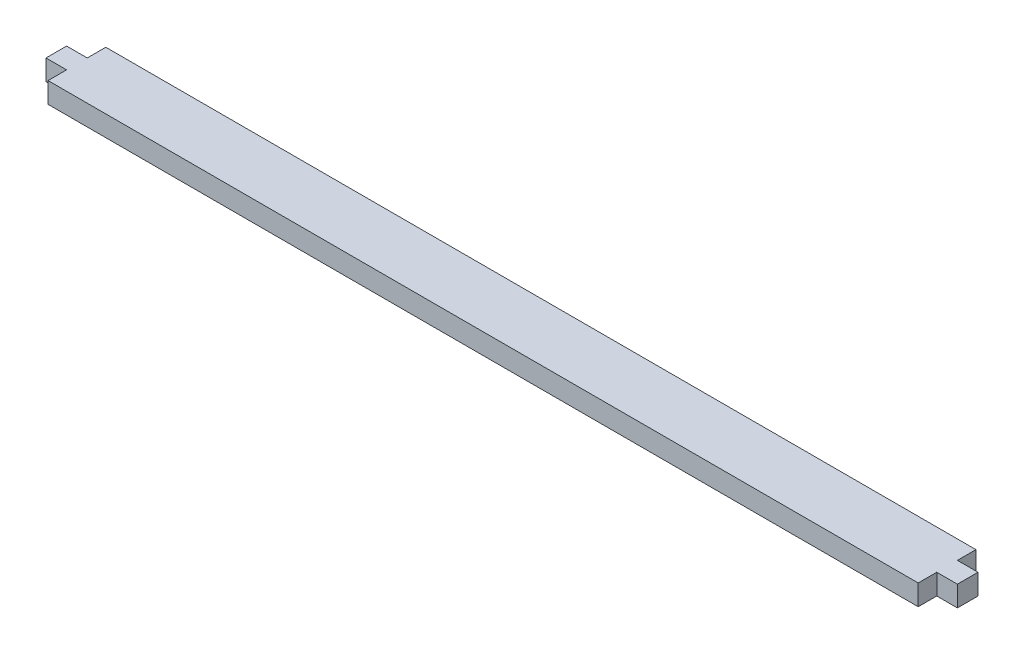
ISO-10303-21;
HEADER;
FILE_DESCRIPTION(('STEP AP214'),'2;1');
FILE_NAME('part.step','',(''),(''),'','','');
FILE_SCHEMA(('AUTOMOTIVE_DESIGN { 1 0 10303 214 1 1 1 1 }'));
ENDSEC;
DATA;
#1=APPLICATION_CONTEXT('core data for automotive mechanical design processes');
#2=APPLICATION_PROTOCOL_DEFINITION('international standard','automotive_design',2000,#1);
#3=PRODUCT_CONTEXT('',#1,'mechanical');
#4=PRODUCT('Part','Part','',(#3));
#5=PRODUCT_RELATED_PRODUCT_CATEGORY('part','',(#4));
#6=PRODUCT_DEFINITION_FORMATION('','',#4);
#7=PRODUCT_DEFINITION_CONTEXT('part definition',#1,'design');
#8=PRODUCT_DEFINITION('design','',#6,#7);
#9=PRODUCT_DEFINITION_SHAPE('','',#8);
#10=(LENGTH_UNIT() NAMED_UNIT(*) SI_UNIT(.MILLI.,.METRE.));
#11=(NAMED_UNIT(*) PLANE_ANGLE_UNIT() SI_UNIT($,.RADIAN.));
#12=(NAMED_UNIT(*) SI_UNIT($,.STERADIAN.) SOLID_ANGLE_UNIT());
#13=UNCERTAINTY_MEASURE_WITH_UNIT(LENGTH_MEASURE(1.E-05),#10,'distance_accuracy_value','');
#14=(GEOMETRIC_REPRESENTATION_CONTEXT(3) GLOBAL_UNCERTAINTY_ASSIGNED_CONTEXT((#13)) GLOBAL_UNIT_ASSIGNED_CONTEXT((#10,
#11,#12)) REPRESENTATION_CONTEXT('',''));
#15=CARTESIAN_POINT('',(0.,0.,0.));
#16=DIRECTION('',(0.,0.,1.));
#17=DIRECTION('',(1.,0.,0.));
#18=AXIS2_PLACEMENT_3D('',#15,#16,#17);
#19=CARTESIAN_POINT('',(-221.,10.,4.99999999999999));
#20=DIRECTION('',(1.,0.,0.));
#21=DIRECTION('',(0.,0.,-1.));
#22=AXIS2_PLACEMENT_3D('',#19,#20,#21);
#23=PLANE('',#22);
#24=DIRECTION('',(0.,0.,1.));
#25=VECTOR('',#24,1.);
#26=CARTESIAN_POINT('',(-221.,0.,4.99999999999999));
#27=LINE('',#26,#25);
#28=CARTESIAN_POINT('',(-221.,0.,-5.00000000000001));
#29=VERTEX_POINT('',#28);
#30=CARTESIAN_POINT('',(-221.,0.,4.99999999999999));
#31=VERTEX_POINT('',#30);
#32=EDGE_CURVE('E153',#29,#31,#27,.T.);
#33=ORIENTED_EDGE('',*,*,#32,.T.);
#34=DIRECTION('',(0.,-1.,0.));
#35=VECTOR('',#34,1.);
#36=CARTESIAN_POINT('',(-221.,10.,4.99999999999999));
#37=LINE('',#36,#35);
#38=CARTESIAN_POINT('',(-221.,10.,4.99999999999999));
#39=VERTEX_POINT('',#38);
#40=EDGE_CURVE('E11',#39,#31,#37,.T.);
#41=ORIENTED_EDGE('',*,*,#40,.F.);
#42=DIRECTION('',(0.,0.,1.));
#43=VECTOR('',#42,1.);
#44=CARTESIAN_POINT('',(-221.,10.,4.99999999999999));
#45=LINE('',#44,#43);
#46=CARTESIAN_POINT('',(-221.,10.,-5.00000000000001));
#47=VERTEX_POINT('',#46);
#48=EDGE_CURVE('E175',#47,#39,#45,.T.);
#49=ORIENTED_EDGE('',*,*,#48,.F.);
#50=DIRECTION('',(0.,-1.,0.));
#51=VECTOR('',#50,1.);
#52=CARTESIAN_POINT('',(-221.,10.,-5.00000000000001));
#53=LINE('',#52,#51);
#54=EDGE_CURVE('E149',#47,#29,#53,.T.);
#55=ORIENTED_EDGE('',*,*,#54,.T.);
#56=EDGE_LOOP('',(#33,#41,#49,#55));
#57=FACE_BOUND('',#56,.T.);
#58=ADVANCED_FACE('F33',(#57),#23,.F.);
#59=CARTESIAN_POINT('',(-211.,10.,4.99999999999999));
#60=DIRECTION('',(0.,0.,-1.));
#61=DIRECTION('',(-1.,0.,0.));
#62=AXIS2_PLACEMENT_3D('',#59,#60,#61);
#63=PLANE('',#62);
#64=DIRECTION('',(1.,0.,0.));
#65=VECTOR('',#64,1.);
#66=CARTESIAN_POINT('',(-211.,0.,4.99999999999999));
#67=LINE('',#66,#65);
#68=CARTESIAN_POINT('',(-211.,0.,4.99999999999999));
#69=VERTEX_POINT('',#68);
#70=EDGE_CURVE('E156',#31,#69,#67,.T.);
#71=ORIENTED_EDGE('',*,*,#70,.T.);
#72=DIRECTION('',(0.,-1.,0.));
#73=VECTOR('',#72,1.);
#74=CARTESIAN_POINT('',(-211.,10.,4.99999999999999));
#75=LINE('',#74,#73);
#76=CARTESIAN_POINT('',(-211.,10.,4.99999999999999));
#77=VERTEX_POINT('',#76);
#78=EDGE_CURVE('E41',#77,#69,#75,.T.);
#79=ORIENTED_EDGE('',*,*,#78,.F.);
#80=DIRECTION('',(1.,0.,0.));
#81=VECTOR('',#80,1.);
#82=CARTESIAN_POINT('',(-211.,10.,4.99999999999999));
#83=LINE('',#82,#81);
#84=EDGE_CURVE('E104',#39,#77,#83,.T.);
#85=ORIENTED_EDGE('',*,*,#84,.F.);
#86=ORIENTED_EDGE('',*,*,#40,.T.);
#87=EDGE_LOOP('',(#71,#79,#85,#86));
#88=FACE_BOUND('',#87,.T.);
#89=ADVANCED_FACE('F253',(#88),#63,.F.);
#90=CARTESIAN_POINT('',(-211.,10.,14.));
#91=DIRECTION('',(1.,0.,0.));
#92=DIRECTION('',(0.,0.,-1.));
#93=AXIS2_PLACEMENT_3D('',#90,#91,#92);
#94=PLANE('',#93);
#95=DIRECTION('',(0.,0.,1.));
#96=VECTOR('',#95,1.);
#97=CARTESIAN_POINT('',(-211.,0.,14.));
#98=LINE('',#97,#96);
#99=CARTESIAN_POINT('',(-211.,0.,14.));
#100=VERTEX_POINT('',#99);
#101=EDGE_CURVE('E158',#69,#100,#98,.T.);
#102=ORIENTED_EDGE('',*,*,#101,.T.);
#103=DIRECTION('',(0.,-1.,0.));
#104=VECTOR('',#103,1.);
#105=CARTESIAN_POINT('',(-211.,10.,14.));
#106=LINE('',#105,#104);
#107=CARTESIAN_POINT('',(-211.,10.,14.));
#108=VERTEX_POINT('',#107);
#109=EDGE_CURVE('E194',#108,#100,#106,.T.);
#110=ORIENTED_EDGE('',*,*,#109,.F.);
#111=DIRECTION('',(0.,0.,1.));
#112=VECTOR('',#111,1.);
#113=CARTESIAN_POINT('',(-211.,10.,14.));
#114=LINE('',#113,#112);
#115=EDGE_CURVE('E202',#77,#108,#114,.T.);
#116=ORIENTED_EDGE('',*,*,#115,.F.);
#117=ORIENTED_EDGE('',*,*,#78,.T.);
#118=EDGE_LOOP('',(#102,#110,#116,#117));
#119=FACE_BOUND('',#118,.T.);
#120=ADVANCED_FACE('F200',(#119),#94,.F.);
#121=CARTESIAN_POINT('',(211.,10.,14.0000000000001));
#122=DIRECTION('',(0.,0.,-1.));
#123=DIRECTION('',(-1.,0.,0.));
#124=AXIS2_PLACEMENT_3D('',#121,#122,#123);
#125=PLANE('',#124);
#126=DIRECTION('',(1.,0.,0.));
#127=VECTOR('',#126,1.);
#128=CARTESIAN_POINT('',(211.,0.,14.0000000000001));
#129=LINE('',#128,#127);
#130=CARTESIAN_POINT('',(211.,0.,14.0000000000001));
#131=VERTEX_POINT('',#130);
#132=EDGE_CURVE('E160',#100,#131,#129,.T.);
#133=ORIENTED_EDGE('',*,*,#132,.T.);
#134=DIRECTION('',(0.,-1.,0.));
#135=VECTOR('',#134,1.);
#136=CARTESIAN_POINT('',(211.,10.,14.0000000000001));
#137=LINE('',#136,#135);
#138=CARTESIAN_POINT('',(211.,10.,14.0000000000001));
#139=VERTEX_POINT('',#138);
#140=EDGE_CURVE('E191',#139,#131,#137,.T.);
#141=ORIENTED_EDGE('',*,*,#140,.F.);
#142=DIRECTION('',(1.,0.,0.));
#143=VECTOR('',#142,1.);
#144=CARTESIAN_POINT('',(211.,10.,14.0000000000001));
#145=LINE('',#144,#143);
#146=EDGE_CURVE('E220',#108,#139,#145,.T.);
#147=ORIENTED_EDGE('',*,*,#146,.F.);
#148=ORIENTED_EDGE('',*,*,#109,.T.);
#149=EDGE_LOOP('',(#133,#141,#147,#148));
#150=FACE_BOUND('',#149,.T.);
#151=ADVANCED_FACE('F211',(#150),#125,.F.);
#152=CARTESIAN_POINT('',(211.,10.,4.99999999999989));
#153=DIRECTION('',(-1.,0.,0.));
#154=DIRECTION('',(0.,0.,1.));
#155=AXIS2_PLACEMENT_3D('',#152,#153,#154);
#156=PLANE('',#155);
#157=DIRECTION('',(0.,0.,-1.));
#158=VECTOR('',#157,1.);
#159=CARTESIAN_POINT('',(211.,0.,4.99999999999989));
#160=LINE('',#159,#158);
#161=CARTESIAN_POINT('',(211.,0.,4.99999999999989));
#162=VERTEX_POINT('',#161);
#163=EDGE_CURVE('E162',#131,#162,#160,.T.);
#164=ORIENTED_EDGE('',*,*,#163,.T.);
#165=DIRECTION('',(0.,-1.,0.));
#166=VECTOR('',#165,1.);
#167=CARTESIAN_POINT('',(211.,10.,4.99999999999989));
#168=LINE('',#167,#166);
#169=CARTESIAN_POINT('',(211.,10.,4.99999999999989));
#170=VERTEX_POINT('',#169);
#171=EDGE_CURVE('E188',#170,#162,#168,.T.);
#172=ORIENTED_EDGE('',*,*,#171,.F.);
#173=DIRECTION('',(0.,0.,-1.));
#174=VECTOR('',#173,1.);
#175=CARTESIAN_POINT('',(211.,10.,4.99999999999989));
#176=LINE('',#175,#174);
#177=EDGE_CURVE('E217',#139,#170,#176,.T.);
#178=ORIENTED_EDGE('',*,*,#177,.F.);
#179=ORIENTED_EDGE('',*,*,#140,.T.);
#180=EDGE_LOOP('',(#164,#172,#178,#179));
#181=FACE_BOUND('',#180,.T.);
#182=ADVANCED_FACE('F215',(#181),#156,.F.);
#183=CARTESIAN_POINT('',(221.,10.,4.99999999999991));
#184=DIRECTION('',(0.,0.,-1.));
#185=DIRECTION('',(-1.,0.,0.));
#186=AXIS2_PLACEMENT_3D('',#183,#184,#185);
#187=PLANE('',#186);
#188=DIRECTION('',(1.,0.,0.));
#189=VECTOR('',#188,1.);
#190=CARTESIAN_POINT('',(221.,0.,4.99999999999991));
#191=LINE('',#190,#189);
#192=CARTESIAN_POINT('',(221.,0.,4.99999999999991));
#193=VERTEX_POINT('',#192);
#194=EDGE_CURVE('E164',#162,#193,#191,.T.);
#195=ORIENTED_EDGE('',*,*,#194,.T.);
#196=DIRECTION('',(0.,-1.,0.));
#197=VECTOR('',#196,1.);
#198=CARTESIAN_POINT('',(221.,10.,4.99999999999991));
#199=LINE('',#198,#197);
#200=CARTESIAN_POINT('',(221.,10.,4.99999999999991));
#201=VERTEX_POINT('',#200);
#202=EDGE_CURVE('E185',#201,#193,#199,.T.);
#203=ORIENTED_EDGE('',*,*,#202,.F.);
#204=DIRECTION('',(1.,0.,0.));
#205=VECTOR('',#204,1.);
#206=CARTESIAN_POINT('',(221.,10.,4.99999999999991));
#207=LINE('',#206,#205);
#208=EDGE_CURVE('E219',#170,#201,#207,.T.);
#209=ORIENTED_EDGE('',*,*,#208,.F.);
#210=ORIENTED_EDGE('',*,*,#171,.T.);
#211=EDGE_LOOP('',(#195,#203,#209,#210));
#212=FACE_BOUND('',#211,.T.);
#213=ADVANCED_FACE('F266',(#212),#187,.F.);
#214=CARTESIAN_POINT('',(221.,10.,-5.00000000000009));
#215=DIRECTION('',(-1.,0.,0.));
#216=DIRECTION('',(0.,0.,1.));
#217=AXIS2_PLACEMENT_3D('',#214,#215,#216);
#218=PLANE('',#217);
#219=DIRECTION('',(0.,0.,-1.));
#220=VECTOR('',#219,1.);
#221=CARTESIAN_POINT('',(221.,0.,-5.00000000000009));
#222=LINE('',#221,#220);
#223=CARTESIAN_POINT('',(221.,0.,-5.00000000000009));
#224=VERTEX_POINT('',#223);
#225=EDGE_CURVE('E166',#193,#224,#222,.T.);
#226=ORIENTED_EDGE('',*,*,#225,.T.);
#227=DIRECTION('',(0.,-1.,0.));
#228=VECTOR('',#227,1.);
#229=CARTESIAN_POINT('',(221.,10.,-5.00000000000009));
#230=LINE('',#229,#228);
#231=CARTESIAN_POINT('',(221.,10.,-5.00000000000009));
#232=VERTEX_POINT('',#231);
#233=EDGE_CURVE('E182',#232,#224,#230,.T.);
#234=ORIENTED_EDGE('',*,*,#233,.F.);
#235=DIRECTION('',(0.,0.,-1.));
#236=VECTOR('',#235,1.);
#237=CARTESIAN_POINT('',(221.,10.,-5.00000000000009));
#238=LINE('',#237,#236);
#239=EDGE_CURVE('E222',#201,#232,#238,.T.);
#240=ORIENTED_EDGE('',*,*,#239,.F.);
#241=ORIENTED_EDGE('',*,*,#202,.T.);
#242=EDGE_LOOP('',(#226,#234,#240,#241));
#243=FACE_BOUND('',#242,.T.);
#244=ADVANCED_FACE('F269',(#243),#218,.F.);
#245=CARTESIAN_POINT('',(211.,10.,-4.99999999999999));
#246=DIRECTION('',(0.,0.,1.));
#247=DIRECTION('',(1.,0.,0.));
#248=AXIS2_PLACEMENT_3D('',#245,#246,#247);
#249=PLANE('',#248);
#250=DIRECTION('',(-1.,0.,0.));
#251=VECTOR('',#250,1.);
#252=CARTESIAN_POINT('',(211.,0.,-4.99999999999999));
#253=LINE('',#252,#251);
#254=CARTESIAN_POINT('',(211.,0.,-4.99999999999999));
#255=VERTEX_POINT('',#254);
#256=EDGE_CURVE('E168',#224,#255,#253,.T.);
#257=ORIENTED_EDGE('',*,*,#256,.T.);
#258=DIRECTION('',(0.,-1.,0.));
#259=VECTOR('',#258,1.);
#260=CARTESIAN_POINT('',(211.,10.,-4.99999999999999));
#261=LINE('',#260,#259);
#262=CARTESIAN_POINT('',(211.,10.,-4.99999999999999));
#263=VERTEX_POINT('',#262);
#264=EDGE_CURVE('E179',#263,#255,#261,.T.);
#265=ORIENTED_EDGE('',*,*,#264,.F.);
#266=DIRECTION('',(-1.,0.,0.));
#267=VECTOR('',#266,1.);
#268=CARTESIAN_POINT('',(211.,10.,-4.99999999999999));
#269=LINE('',#268,#267);
#270=EDGE_CURVE('E228',#232,#263,#269,.T.);
#271=ORIENTED_EDGE('',*,*,#270,.F.);
#272=ORIENTED_EDGE('',*,*,#233,.T.);
#273=EDGE_LOOP('',(#257,#265,#271,#272));
#274=FACE_BOUND('',#273,.T.);
#275=ADVANCED_FACE('F234',(#274),#249,.F.);
#276=CARTESIAN_POINT('',(211.,10.,-14.0000000000001));
#277=DIRECTION('',(-1.,0.,0.));
#278=DIRECTION('',(0.,0.,1.));
#279=AXIS2_PLACEMENT_3D('',#276,#277,#278);
#280=PLANE('',#279);
#281=DIRECTION('',(0.,0.,-1.));
#282=VECTOR('',#281,1.);
#283=CARTESIAN_POINT('',(211.,0.,-14.0000000000001));
#284=LINE('',#283,#282);
#285=CARTESIAN_POINT('',(211.,0.,-14.0000000000001));
#286=VERTEX_POINT('',#285);
#287=EDGE_CURVE('E170',#255,#286,#284,.T.);
#288=ORIENTED_EDGE('',*,*,#287,.T.);
#289=DIRECTION('',(0.,-1.,0.));
#290=VECTOR('',#289,1.);
#291=CARTESIAN_POINT('',(211.,10.,-14.0000000000001));
#292=LINE('',#291,#290);
#293=CARTESIAN_POINT('',(211.,10.,-14.0000000000001));
#294=VERTEX_POINT('',#293);
#295=EDGE_CURVE('E144',#294,#286,#292,.T.);
#296=ORIENTED_EDGE('',*,*,#295,.F.);
#297=DIRECTION('',(0.,0.,-1.));
#298=VECTOR('',#297,1.);
#299=CARTESIAN_POINT('',(211.,10.,-14.0000000000001));
#300=LINE('',#299,#298);
#301=EDGE_CURVE('E135',#263,#294,#300,.T.);
#302=ORIENTED_EDGE('',*,*,#301,.F.);
#303=ORIENTED_EDGE('',*,*,#264,.T.);
#304=EDGE_LOOP('',(#288,#296,#302,#303));
#305=FACE_BOUND('',#304,.T.);
#306=ADVANCED_FACE('F238',(#305),#280,.F.);
#307=CARTESIAN_POINT('',(-211.,10.,-14.));
#308=DIRECTION('',(0.,0.,1.));
#309=DIRECTION('',(1.,0.,0.));
#310=AXIS2_PLACEMENT_3D('',#307,#308,#309);
#311=PLANE('',#310);
#312=DIRECTION('',(-1.,0.,0.));
#313=VECTOR('',#312,1.);
#314=CARTESIAN_POINT('',(-211.,0.,-14.));
#315=LINE('',#314,#313);
#316=CARTESIAN_POINT('',(-211.,0.,-14.));
#317=VERTEX_POINT('',#316);
#318=EDGE_CURVE('E143',#286,#317,#315,.T.);
#319=ORIENTED_EDGE('',*,*,#318,.T.);
#320=DIRECTION('',(0.,-1.,0.));
#321=VECTOR('',#320,1.);
#322=CARTESIAN_POINT('',(-211.,10.,-14.));
#323=LINE('',#322,#321);
#324=CARTESIAN_POINT('',(-211.,10.,-14.));
#325=VERTEX_POINT('',#324);
#326=EDGE_CURVE('E140',#325,#317,#323,.T.);
#327=ORIENTED_EDGE('',*,*,#326,.F.);
#328=DIRECTION('',(-1.,0.,0.));
#329=VECTOR('',#328,1.);
#330=CARTESIAN_POINT('',(-211.,10.,-14.));
#331=LINE('',#330,#329);
#332=EDGE_CURVE('E129',#294,#325,#331,.T.);
#333=ORIENTED_EDGE('',*,*,#332,.F.);
#334=ORIENTED_EDGE('',*,*,#295,.T.);
#335=EDGE_LOOP('',(#319,#327,#333,#334));
#336=FACE_BOUND('',#335,.T.);
#337=ADVANCED_FACE('F141',(#336),#311,.F.);
#338=CARTESIAN_POINT('',(-211.,10.,-4.99999999999999));
#339=DIRECTION('',(1.,0.,0.));
#340=DIRECTION('',(0.,0.,-1.));
#341=AXIS2_PLACEMENT_3D('',#338,#339,#340);
#342=PLANE('',#341);
#343=DIRECTION('',(0.,0.,1.));
#344=VECTOR('',#343,1.);
#345=CARTESIAN_POINT('',(-211.,0.,-4.99999999999999));
#346=LINE('',#345,#344);
#347=CARTESIAN_POINT('',(-211.,0.,-4.99999999999999));
#348=VERTEX_POINT('',#347);
#349=EDGE_CURVE('E90',#317,#348,#346,.T.);
#350=ORIENTED_EDGE('',*,*,#349,.T.);
#351=DIRECTION('',(0.,-1.,0.));
#352=VECTOR('',#351,1.);
#353=CARTESIAN_POINT('',(-211.,10.,-4.99999999999999));
#354=LINE('',#353,#352);
#355=CARTESIAN_POINT('',(-211.,10.,-4.99999999999999));
#356=VERTEX_POINT('',#355);
#357=EDGE_CURVE('E145',#356,#348,#354,.T.);
#358=ORIENTED_EDGE('',*,*,#357,.F.);
#359=DIRECTION('',(0.,0.,1.));
#360=VECTOR('',#359,1.);
#361=CARTESIAN_POINT('',(-211.,10.,-4.99999999999999));
#362=LINE('',#361,#360);
#363=EDGE_CURVE('E133',#325,#356,#362,.T.);
#364=ORIENTED_EDGE('',*,*,#363,.F.);
#365=ORIENTED_EDGE('',*,*,#326,.T.);
#366=EDGE_LOOP('',(#350,#358,#364,#365));
#367=FACE_BOUND('',#366,.T.);
#368=ADVANCED_FACE('F147',(#367),#342,.F.);
#369=CARTESIAN_POINT('',(-221.,10.,-5.00000000000001));
#370=DIRECTION('',(0.,0.,1.));
#371=DIRECTION('',(1.,0.,0.));
#372=AXIS2_PLACEMENT_3D('',#369,#370,#371);
#373=PLANE('',#372);
#374=DIRECTION('',(-1.,0.,0.));
#375=VECTOR('',#374,1.);
#376=CARTESIAN_POINT('',(-221.,0.,-5.00000000000001));
#377=LINE('',#376,#375);
#378=EDGE_CURVE('E96',#348,#29,#377,.T.);
#379=ORIENTED_EDGE('',*,*,#378,.T.);
#380=ORIENTED_EDGE('',*,*,#54,.F.);
#381=DIRECTION('',(-1.,0.,0.));
#382=VECTOR('',#381,1.);
#383=CARTESIAN_POINT('',(-221.,10.,-5.00000000000001));
#384=LINE('',#383,#382);
#385=EDGE_CURVE('E49',#356,#47,#384,.T.);
#386=ORIENTED_EDGE('',*,*,#385,.F.);
#387=ORIENTED_EDGE('',*,*,#357,.T.);
#388=EDGE_LOOP('',(#379,#380,#386,#387));
#389=FACE_BOUND('',#388,.T.);
#390=ADVANCED_FACE('F242',(#389),#373,.F.);
#391=CARTESIAN_POINT('',(0.,10.,0.));
#392=DIRECTION('',(0.,-1.,0.));
#393=DIRECTION('',(0.,0.,-1.));
#394=AXIS2_PLACEMENT_3D('',#391,#392,#393);
#395=PLANE('',#394);
#396=ORIENTED_EDGE('',*,*,#48,.T.);
#397=ORIENTED_EDGE('',*,*,#84,.T.);
#398=ORIENTED_EDGE('',*,*,#115,.T.);
#399=ORIENTED_EDGE('',*,*,#146,.T.);
#400=ORIENTED_EDGE('',*,*,#177,.T.);
#401=ORIENTED_EDGE('',*,*,#208,.T.);
#402=ORIENTED_EDGE('',*,*,#239,.T.);
#403=ORIENTED_EDGE('',*,*,#270,.T.);
#404=ORIENTED_EDGE('',*,*,#301,.T.);
#405=ORIENTED_EDGE('',*,*,#332,.T.);
#406=ORIENTED_EDGE('',*,*,#363,.T.);
#407=ORIENTED_EDGE('',*,*,#385,.T.);
#408=EDGE_LOOP('',(#396,#397,#398,#399,#400,#401,#402,#403,#404,#405,#406,#407));
#409=FACE_BOUND('',#408,.T.);
#410=ADVANCED_FACE('F131',(#409),#395,.F.);
#411=CARTESIAN_POINT('',(0.,0.,0.));
#412=DIRECTION('',(0.,-1.,0.));
#413=DIRECTION('',(0.,0.,-1.));
#414=AXIS2_PLACEMENT_3D('',#411,#412,#413);
#415=PLANE('',#414);
#416=ORIENTED_EDGE('',*,*,#32,.F.);
#417=ORIENTED_EDGE('',*,*,#378,.F.);
#418=ORIENTED_EDGE('',*,*,#349,.F.);
#419=ORIENTED_EDGE('',*,*,#318,.F.);
#420=ORIENTED_EDGE('',*,*,#287,.F.);
#421=ORIENTED_EDGE('',*,*,#256,.F.);
#422=ORIENTED_EDGE('',*,*,#225,.F.);
#423=ORIENTED_EDGE('',*,*,#194,.F.);
#424=ORIENTED_EDGE('',*,*,#163,.F.);
#425=ORIENTED_EDGE('',*,*,#132,.F.);
#426=ORIENTED_EDGE('',*,*,#101,.F.);
#427=ORIENTED_EDGE('',*,*,#70,.F.);
#428=EDGE_LOOP('',(#416,#417,#418,#419,#420,#421,#422,#423,#424,#425,#426,#427));
#429=FACE_BOUND('',#428,.T.);
#430=ADVANCED_FACE('F206',(#429),#415,.T.);
#431=CLOSED_SHELL('',(#58,#89,#120,#151,#182,#213,#244,#275,#306,#337,#368,#390,#410,#430));
#432=MANIFOLD_SOLID_BREP('B2',#431);
#433=ADVANCED_BREP_SHAPE_REPRESENTATION('',(#18,#432),#14);
#434=SHAPE_DEFINITION_REPRESENTATION(#9,#433);
ENDSEC;
END-ISO-10303-21;
